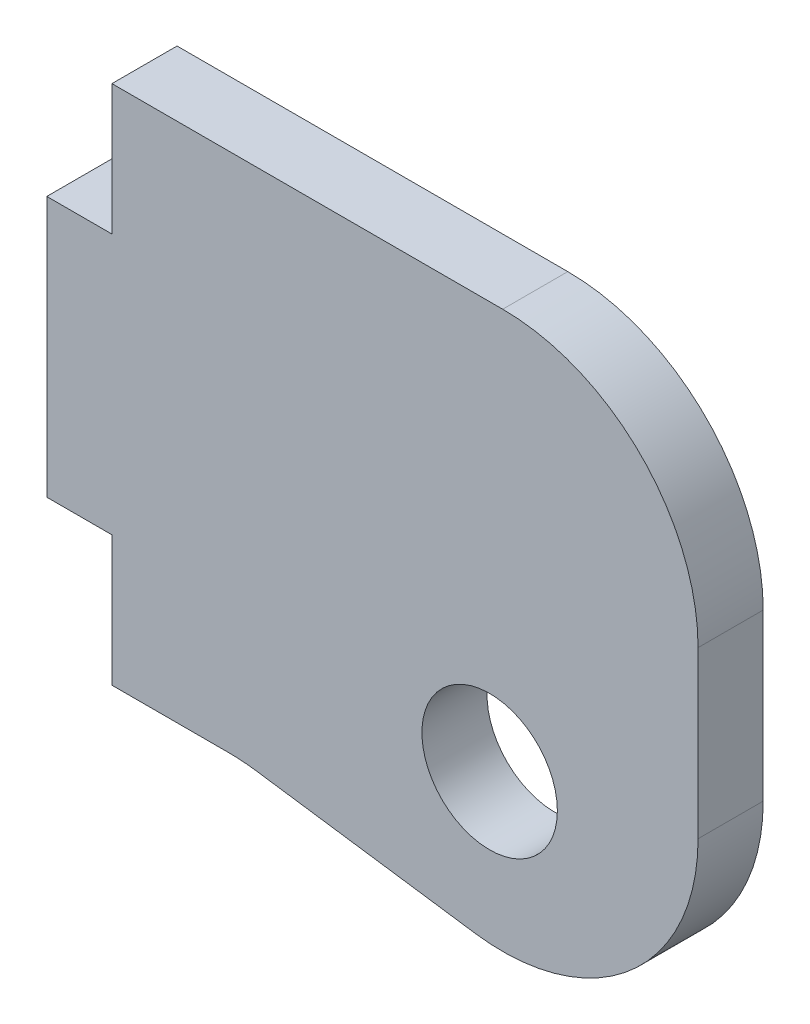
ISO-10303-21;
HEADER;
FILE_DESCRIPTION(('STEP AP214'),'2;1');
FILE_NAME('part.step','',(''),(''),'','','');
FILE_SCHEMA(('AUTOMOTIVE_DESIGN { 1 0 10303 214 1 1 1 1 }'));
ENDSEC;
DATA;
#1=APPLICATION_CONTEXT('core data for automotive mechanical design processes');
#2=APPLICATION_PROTOCOL_DEFINITION('international standard','automotive_design',2000,#1);
#3=PRODUCT_CONTEXT('',#1,'mechanical');
#4=PRODUCT('Part','Part','',(#3));
#5=PRODUCT_RELATED_PRODUCT_CATEGORY('part','',(#4));
#6=PRODUCT_DEFINITION_FORMATION('','',#4);
#7=PRODUCT_DEFINITION_CONTEXT('part definition',#1,'design');
#8=PRODUCT_DEFINITION('design','',#6,#7);
#9=PRODUCT_DEFINITION_SHAPE('','',#8);
#10=(LENGTH_UNIT() NAMED_UNIT(*) SI_UNIT(.MILLI.,.METRE.));
#11=(NAMED_UNIT(*) PLANE_ANGLE_UNIT() SI_UNIT($,.RADIAN.));
#12=(NAMED_UNIT(*) SI_UNIT($,.STERADIAN.) SOLID_ANGLE_UNIT());
#13=UNCERTAINTY_MEASURE_WITH_UNIT(LENGTH_MEASURE(1.E-05),#10,'distance_accuracy_value','');
#14=(GEOMETRIC_REPRESENTATION_CONTEXT(3) GLOBAL_UNCERTAINTY_ASSIGNED_CONTEXT((#13)) GLOBAL_UNIT_ASSIGNED_CONTEXT((#10,
#11,#12)) REPRESENTATION_CONTEXT('',''));
#15=CARTESIAN_POINT('',(0.,0.,0.));
#16=DIRECTION('',(0.,0.,1.));
#17=DIRECTION('',(1.,0.,0.));
#18=AXIS2_PLACEMENT_3D('',#15,#16,#17);
#19=CARTESIAN_POINT('',(31.75,12.7,3.175));
#20=DIRECTION('',(0.,-1.,0.));
#21=DIRECTION('',(1.,0.,0.));
#22=AXIS2_PLACEMENT_3D('',#19,#20,#21);
#23=PLANE('',#22);
#24=DIRECTION('',(-1.,0.,0.));
#25=VECTOR('',#24,1.);
#26=CARTESIAN_POINT('',(31.75,12.7,0.));
#27=LINE('',#26,#25);
#28=CARTESIAN_POINT('',(22.225,12.7,0.));
#29=VERTEX_POINT('',#28);
#30=CARTESIAN_POINT('',(3.175,12.7,0.));
#31=VERTEX_POINT('',#30);
#32=EDGE_CURVE('E150',#29,#31,#27,.T.);
#33=ORIENTED_EDGE('',*,*,#32,.T.);
#34=DIRECTION('',(0.,0.,1.));
#35=VECTOR('',#34,1.);
#36=CARTESIAN_POINT('',(3.175,12.7,0.));
#37=LINE('',#36,#35);
#38=CARTESIAN_POINT('',(3.175,12.7,3.175));
#39=VERTEX_POINT('',#38);
#40=EDGE_CURVE('E197',#31,#39,#37,.T.);
#41=ORIENTED_EDGE('',*,*,#40,.T.);
#42=DIRECTION('',(-1.,0.,0.));
#43=VECTOR('',#42,1.);
#44=CARTESIAN_POINT('',(31.75,12.7,3.175));
#45=LINE('',#44,#43);
#46=CARTESIAN_POINT('',(22.225,12.7,3.175));
#47=VERTEX_POINT('',#46);
#48=EDGE_CURVE('E156',#47,#39,#45,.T.);
#49=ORIENTED_EDGE('',*,*,#48,.F.);
#50=DIRECTION('',(0.,0.,-1.));
#51=VECTOR('',#50,1.);
#52=CARTESIAN_POINT('',(22.225,12.7,3.175));
#53=LINE('',#52,#51);
#54=EDGE_CURVE('E165',#47,#29,#53,.T.);
#55=ORIENTED_EDGE('',*,*,#54,.T.);
#56=EDGE_LOOP('',(#33,#41,#49,#55));
#57=FACE_BOUND('',#56,.T.);
#58=ADVANCED_FACE('F34',(#57),#23,.F.);
#59=CARTESIAN_POINT('',(0.,12.7,3.175));
#60=DIRECTION('',(1.,0.,0.));
#61=DIRECTION('',(0.,1.,0.));
#62=AXIS2_PLACEMENT_3D('',#59,#60,#61);
#63=PLANE('',#62);
#64=DIRECTION('',(0.,-1.,0.));
#65=VECTOR('',#64,1.);
#66=CARTESIAN_POINT('',(0.,12.7,0.));
#67=LINE('',#66,#65);
#68=CARTESIAN_POINT('',(0.,6.35000000000001,0.));
#69=VERTEX_POINT('',#68);
#70=CARTESIAN_POINT('',(0.,-6.34999999999999,0.));
#71=VERTEX_POINT('',#70);
#72=EDGE_CURVE('E144',#69,#71,#67,.T.);
#73=ORIENTED_EDGE('',*,*,#72,.T.);
#74=DIRECTION('',(0.,0.,1.));
#75=VECTOR('',#74,1.);
#76=CARTESIAN_POINT('',(0.,-6.34999999999999,0.));
#77=LINE('',#76,#75);
#78=CARTESIAN_POINT('',(0.,-6.34999999999999,3.175));
#79=VERTEX_POINT('',#78);
#80=EDGE_CURVE('E230',#71,#79,#77,.T.);
#81=ORIENTED_EDGE('',*,*,#80,.T.);
#82=DIRECTION('',(0.,-1.,0.));
#83=VECTOR('',#82,1.);
#84=CARTESIAN_POINT('',(0.,12.7,3.175));
#85=LINE('',#84,#83);
#86=CARTESIAN_POINT('',(0.,6.35000000000001,3.175));
#87=VERTEX_POINT('',#86);
#88=EDGE_CURVE('E198',#87,#79,#85,.T.);
#89=ORIENTED_EDGE('',*,*,#88,.F.);
#90=DIRECTION('',(0.,0.,1.));
#91=VECTOR('',#90,1.);
#92=CARTESIAN_POINT('',(0.,6.35000000000001,0.));
#93=LINE('',#92,#91);
#94=EDGE_CURVE('E233',#69,#87,#93,.T.);
#95=ORIENTED_EDGE('',*,*,#94,.F.);
#96=EDGE_LOOP('',(#73,#81,#89,#95));
#97=FACE_BOUND('',#96,.T.);
#98=ADVANCED_FACE('F255',(#97),#63,.F.);
#99=CARTESIAN_POINT('',(0.,-12.7,3.175));
#100=DIRECTION('',(0.,1.,0.));
#101=DIRECTION('',(-1.,0.,0.));
#102=AXIS2_PLACEMENT_3D('',#99,#100,#101);
#103=PLANE('',#102);
#104=DIRECTION('',(1.,0.,0.));
#105=VECTOR('',#104,1.);
#106=CARTESIAN_POINT('',(0.,-12.7,3.175));
#107=LINE('',#106,#105);
#108=CARTESIAN_POINT('',(3.175,-12.7,3.175));
#109=VERTEX_POINT('',#108);
#110=CARTESIAN_POINT('',(8.84807909198137,-12.7,3.175));
#111=VERTEX_POINT('',#110);
#112=EDGE_CURVE('E138',#109,#111,#107,.T.);
#113=ORIENTED_EDGE('',*,*,#112,.F.);
#114=DIRECTION('',(0.,0.,1.));
#115=VECTOR('',#114,1.);
#116=CARTESIAN_POINT('',(3.175,-12.7,0.));
#117=LINE('',#116,#115);
#118=CARTESIAN_POINT('',(3.175,-12.7,0.));
#119=VERTEX_POINT('',#118);
#120=EDGE_CURVE('E125',#119,#109,#117,.T.);
#121=ORIENTED_EDGE('',*,*,#120,.F.);
#122=DIRECTION('',(1.,0.,0.));
#123=VECTOR('',#122,1.);
#124=CARTESIAN_POINT('',(0.,-12.7,0.));
#125=LINE('',#124,#123);
#126=CARTESIAN_POINT('',(8.84807909198137,-12.7,0.));
#127=VERTEX_POINT('',#126);
#128=EDGE_CURVE('E136',#119,#127,#125,.T.);
#129=ORIENTED_EDGE('',*,*,#128,.T.);
#130=DIRECTION('',(0.,0.,-1.));
#131=VECTOR('',#130,1.);
#132=CARTESIAN_POINT('',(8.84807909198137,-12.7,3.175));
#133=LINE('',#132,#131);
#134=EDGE_CURVE('E163',#127,#111,#133,.F.);
#135=ORIENTED_EDGE('',*,*,#134,.T.);
#136=EDGE_LOOP('',(#113,#121,#129,#135));
#137=FACE_BOUND('',#136,.T.);
#138=ADVANCED_FACE('F134',(#137),#103,.F.);
#139=CARTESIAN_POINT('',(9.525,-12.7,3.175));
#140=DIRECTION('',(0.141421356237309,0.989949493661167,0.));
#141=DIRECTION('',(-0.989949493661167,0.141421356237309,0.));
#142=AXIS2_PLACEMENT_3D('',#139,#140,#141);
#143=PLANE('',#142);
#144=DIRECTION('',(0.989949493661167,-0.141421356237309,0.));
#145=VECTOR('',#144,1.);
#146=CARTESIAN_POINT('',(9.525,-12.7,3.175));
#147=LINE('',#146,#145);
#148=CARTESIAN_POINT('',(10.1951175101417,-12.7957310728774,3.175));
#149=VERTEX_POINT('',#148);
#150=CARTESIAN_POINT('',(20.8779615818396,-14.3218516545485,3.175));
#151=VERTEX_POINT('',#150);
#152=EDGE_CURVE('E213',#149,#151,#147,.T.);
#153=ORIENTED_EDGE('',*,*,#152,.F.);
#154=DIRECTION('',(0.,0.,-1.));
#155=VECTOR('',#154,1.);
#156=CARTESIAN_POINT('',(10.1951175101417,-12.7957310728774,0.));
#157=LINE('',#156,#155);
#158=CARTESIAN_POINT('',(10.1951175101417,-12.7957310728774,0.));
#159=VERTEX_POINT('',#158);
#160=EDGE_CURVE('E159',#149,#159,#157,.T.);
#161=ORIENTED_EDGE('',*,*,#160,.T.);
#162=DIRECTION('',(0.989949493661167,-0.141421356237309,0.));
#163=VECTOR('',#162,1.);
#164=CARTESIAN_POINT('',(9.525,-12.7,0.));
#165=LINE('',#164,#163);
#166=CARTESIAN_POINT('',(20.8779615818396,-14.3218516545485,0.));
#167=VERTEX_POINT('',#166);
#168=EDGE_CURVE('E143',#159,#167,#165,.T.);
#169=ORIENTED_EDGE('',*,*,#168,.T.);
#170=DIRECTION('',(0.,0.,-1.));
#171=VECTOR('',#170,1.);
#172=CARTESIAN_POINT('',(20.8779615818396,-14.3218516545485,3.175));
#173=LINE('',#172,#171);
#174=EDGE_CURVE('E157',#167,#151,#173,.F.);
#175=ORIENTED_EDGE('',*,*,#174,.T.);
#176=EDGE_LOOP('',(#153,#161,#169,#175));
#177=FACE_BOUND('',#176,.T.);
#178=ADVANCED_FACE('F210',(#177),#143,.F.);
#179=CARTESIAN_POINT('',(31.75,-15.875,3.175));
#180=DIRECTION('',(-1.,0.,0.));
#181=DIRECTION('',(0.,-1.,0.));
#182=AXIS2_PLACEMENT_3D('',#179,#180,#181);
#183=PLANE('',#182);
#184=DIRECTION('',(0.,1.,0.));
#185=VECTOR('',#184,1.);
#186=CARTESIAN_POINT('',(31.75,-15.875,0.));
#187=LINE('',#186,#185);
#188=CARTESIAN_POINT('',(31.75,-4.8925827274259,0.));
#189=VERTEX_POINT('',#188);
#190=CARTESIAN_POINT('',(31.75,3.17500000000001,0.));
#191=VERTEX_POINT('',#190);
#192=EDGE_CURVE('E147',#189,#191,#187,.T.);
#193=ORIENTED_EDGE('',*,*,#192,.T.);
#194=DIRECTION('',(0.,0.,-1.));
#195=VECTOR('',#194,1.);
#196=CARTESIAN_POINT('',(31.75,3.17500000000001,3.175));
#197=LINE('',#196,#195);
#198=CARTESIAN_POINT('',(31.75,3.17500000000001,3.175));
#199=VERTEX_POINT('',#198);
#200=EDGE_CURVE('E175',#191,#199,#197,.F.);
#201=ORIENTED_EDGE('',*,*,#200,.T.);
#202=DIRECTION('',(0.,1.,0.));
#203=VECTOR('',#202,1.);
#204=CARTESIAN_POINT('',(31.75,-15.875,3.175));
#205=LINE('',#204,#203);
#206=CARTESIAN_POINT('',(31.75,-4.8925827274259,3.175));
#207=VERTEX_POINT('',#206);
#208=EDGE_CURVE('E160',#207,#199,#205,.T.);
#209=ORIENTED_EDGE('',*,*,#208,.F.);
#210=DIRECTION('',(0.,0.,-1.));
#211=VECTOR('',#210,1.);
#212=CARTESIAN_POINT('',(31.75,-4.8925827274259,3.175));
#213=LINE('',#212,#211);
#214=EDGE_CURVE('E172',#207,#189,#213,.T.);
#215=ORIENTED_EDGE('',*,*,#214,.T.);
#216=EDGE_LOOP('',(#193,#201,#209,#215));
#217=FACE_BOUND('',#216,.T.);
#218=ADVANCED_FACE('F203',(#217),#183,.F.);
#219=CARTESIAN_POINT('',(0.,0.,3.175));
#220=DIRECTION('',(0.,0.,1.));
#221=DIRECTION('',(1.,0.,0.));
#222=AXIS2_PLACEMENT_3D('',#219,#220,#221);
#223=PLANE('',#222);
#224=DIRECTION('',(-1.,0.,0.));
#225=VECTOR('',#224,1.);
#226=CARTESIAN_POINT('',(0.,-6.34999999999999,3.175));
#227=LINE('',#226,#225);
#228=CARTESIAN_POINT('',(3.175,-6.34999999999999,3.175));
#229=VERTEX_POINT('',#228);
#230=EDGE_CURVE('E130',#229,#79,#227,.T.);
#231=ORIENTED_EDGE('',*,*,#230,.F.);
#232=DIRECTION('',(0.,1.,0.));
#233=VECTOR('',#232,1.);
#234=CARTESIAN_POINT('',(3.175,-12.7,3.175));
#235=LINE('',#234,#233);
#236=EDGE_CURVE('E217',#109,#229,#235,.T.);
#237=ORIENTED_EDGE('',*,*,#236,.F.);
#238=ORIENTED_EDGE('',*,*,#112,.T.);
#239=CARTESIAN_POINT('',(8.84807909198136,-22.225,3.175));
#240=DIRECTION('',(0.,0.,1.));
#241=DIRECTION('',(1.,0.,0.));
#242=AXIS2_PLACEMENT_3D('',#239,#240,#241);
#243=CIRCLE('',#242,9.525);
#244=EDGE_CURVE('E11',#111,#149,#243,.F.);
#245=ORIENTED_EDGE('',*,*,#244,.T.);
#246=ORIENTED_EDGE('',*,*,#152,.T.);
#247=CARTESIAN_POINT('',(22.225,-4.8925827274259,3.175));
#248=DIRECTION('',(0.,0.,1.));
#249=DIRECTION('',(1.,0.,0.));
#250=AXIS2_PLACEMENT_3D('',#247,#248,#249);
#251=CIRCLE('',#250,9.525);
#252=EDGE_CURVE('E177',#151,#207,#251,.T.);
#253=ORIENTED_EDGE('',*,*,#252,.T.);
#254=ORIENTED_EDGE('',*,*,#208,.T.);
#255=CARTESIAN_POINT('',(22.225,3.17500000000001,3.175));
#256=DIRECTION('',(0.,0.,1.));
#257=DIRECTION('',(1.,0.,0.));
#258=AXIS2_PLACEMENT_3D('',#255,#256,#257);
#259=CIRCLE('',#258,9.525);
#260=EDGE_CURVE('E179',#199,#47,#259,.T.);
#261=ORIENTED_EDGE('',*,*,#260,.T.);
#262=ORIENTED_EDGE('',*,*,#48,.T.);
#263=DIRECTION('',(0.,1.,0.));
#264=VECTOR('',#263,1.);
#265=CARTESIAN_POINT('',(3.175,12.7,3.175));
#266=LINE('',#265,#264);
#267=CARTESIAN_POINT('',(3.175,6.35000000000001,3.175));
#268=VERTEX_POINT('',#267);
#269=EDGE_CURVE('E238',#268,#39,#266,.T.);
#270=ORIENTED_EDGE('',*,*,#269,.F.);
#271=DIRECTION('',(1.,0.,0.));
#272=VECTOR('',#271,1.);
#273=CARTESIAN_POINT('',(0.,6.35000000000001,3.175));
#274=LINE('',#273,#272);
#275=EDGE_CURVE('E241',#87,#268,#274,.T.);
#276=ORIENTED_EDGE('',*,*,#275,.F.);
#277=ORIENTED_EDGE('',*,*,#88,.T.);
#278=EDGE_LOOP('',(#231,#237,#238,#245,#246,#253,#254,#261,#262,#270,#276,#277));
#279=FACE_BOUND('',#278,.T.);
#280=CARTESIAN_POINT('',(21.5882999780113,-7.14087159890308,3.175));
#281=DIRECTION('',(0.,0.,1.));
#282=DIRECTION('',(1.,0.,0.));
#283=AXIS2_PLACEMENT_3D('',#280,#281,#282);
#284=CIRCLE('',#283,3.302);
#285=CARTESIAN_POINT('',(24.8902999780113,-7.14087159890308,3.175));
#286=VERTEX_POINT('',#285);
#287=EDGE_CURVE('E225',#286,#286,#284,.T.);
#288=ORIENTED_EDGE('',*,*,#287,.F.);
#289=EDGE_LOOP('',(#288));
#290=FACE_BOUND('',#289,.T.);
#291=ADVANCED_FACE('F186',(#279,#290),#223,.T.);
#292=CARTESIAN_POINT('',(0.,0.,0.));
#293=DIRECTION('',(0.,0.,1.));
#294=DIRECTION('',(1.,0.,0.));
#295=AXIS2_PLACEMENT_3D('',#292,#293,#294);
#296=PLANE('',#295);
#297=CARTESIAN_POINT('',(21.5882999780113,-7.14087159890308,0.));
#298=DIRECTION('',(0.,0.,1.));
#299=DIRECTION('',(1.,0.,0.));
#300=AXIS2_PLACEMENT_3D('',#297,#298,#299);
#301=CIRCLE('',#300,3.302);
#302=CARTESIAN_POINT('',(24.8902999780113,-7.14087159890308,0.));
#303=VERTEX_POINT('',#302);
#304=EDGE_CURVE('E223',#303,#303,#301,.T.);
#305=ORIENTED_EDGE('',*,*,#304,.T.);
#306=EDGE_LOOP('',(#305));
#307=FACE_BOUND('',#306,.T.);
#308=DIRECTION('',(0.,1.,0.));
#309=VECTOR('',#308,1.);
#310=CARTESIAN_POINT('',(3.175,-12.7,0.));
#311=LINE('',#310,#309);
#312=CARTESIAN_POINT('',(3.175,-6.34999999999999,0.));
#313=VERTEX_POINT('',#312);
#314=EDGE_CURVE('E121',#119,#313,#311,.T.);
#315=ORIENTED_EDGE('',*,*,#314,.T.);
#316=DIRECTION('',(-1.,0.,0.));
#317=VECTOR('',#316,1.);
#318=CARTESIAN_POINT('',(0.,-6.34999999999999,0.));
#319=LINE('',#318,#317);
#320=EDGE_CURVE('E49',#313,#71,#319,.T.);
#321=ORIENTED_EDGE('',*,*,#320,.T.);
#322=ORIENTED_EDGE('',*,*,#72,.F.);
#323=DIRECTION('',(1.,0.,0.));
#324=VECTOR('',#323,1.);
#325=CARTESIAN_POINT('',(0.,6.35000000000001,0.));
#326=LINE('',#325,#324);
#327=CARTESIAN_POINT('',(3.175,6.35000000000001,0.));
#328=VERTEX_POINT('',#327);
#329=EDGE_CURVE('E240',#69,#328,#326,.T.);
#330=ORIENTED_EDGE('',*,*,#329,.T.);
#331=DIRECTION('',(0.,1.,0.));
#332=VECTOR('',#331,1.);
#333=CARTESIAN_POINT('',(3.175,12.7,0.));
#334=LINE('',#333,#332);
#335=EDGE_CURVE('E57',#328,#31,#334,.T.);
#336=ORIENTED_EDGE('',*,*,#335,.T.);
#337=ORIENTED_EDGE('',*,*,#32,.F.);
#338=CARTESIAN_POINT('',(22.225,3.17500000000001,0.));
#339=DIRECTION('',(0.,0.,1.));
#340=DIRECTION('',(1.,0.,0.));
#341=AXIS2_PLACEMENT_3D('',#338,#339,#340);
#342=CIRCLE('',#341,9.525);
#343=EDGE_CURVE('E170',#29,#191,#342,.F.);
#344=ORIENTED_EDGE('',*,*,#343,.T.);
#345=ORIENTED_EDGE('',*,*,#192,.F.);
#346=CARTESIAN_POINT('',(22.225,-4.8925827274259,0.));
#347=DIRECTION('',(0.,0.,1.));
#348=DIRECTION('',(1.,0.,0.));
#349=AXIS2_PLACEMENT_3D('',#346,#347,#348);
#350=CIRCLE('',#349,9.525);
#351=EDGE_CURVE('E168',#189,#167,#350,.F.);
#352=ORIENTED_EDGE('',*,*,#351,.T.);
#353=ORIENTED_EDGE('',*,*,#168,.F.);
#354=CARTESIAN_POINT('',(8.84807909198136,-22.225,0.));
#355=DIRECTION('',(0.,0.,1.));
#356=DIRECTION('',(1.,0.,0.));
#357=AXIS2_PLACEMENT_3D('',#354,#355,#356);
#358=CIRCLE('',#357,9.525);
#359=EDGE_CURVE('E42',#159,#127,#358,.T.);
#360=ORIENTED_EDGE('',*,*,#359,.T.);
#361=ORIENTED_EDGE('',*,*,#128,.F.);
#362=EDGE_LOOP('',(#315,#321,#322,#330,#336,#337,#344,#345,#352,#353,#360,#361));
#363=FACE_BOUND('',#362,.T.);
#364=ADVANCED_FACE('F140',(#307,#363),#296,.F.);
#365=CARTESIAN_POINT('',(21.5882999780113,-7.14087159890308,0.));
#366=DIRECTION('',(0.,0.,1.));
#367=DIRECTION('',(1.,0.,0.));
#368=AXIS2_PLACEMENT_3D('',#365,#366,#367);
#369=CYLINDRICAL_SURFACE('',#368,3.302);
#370=ORIENTED_EDGE('',*,*,#304,.F.);
#371=EDGE_LOOP('',(#370));
#372=FACE_BOUND('',#371,.T.);
#373=ORIENTED_EDGE('',*,*,#287,.T.);
#374=EDGE_LOOP('',(#373));
#375=FACE_BOUND('',#374,.T.);
#376=ADVANCED_FACE('F279',(#372,#375),#369,.F.);
#377=CARTESIAN_POINT('',(8.84807909198136,-22.225,3.175));
#378=DIRECTION('',(0.,0.,1.));
#379=DIRECTION('',(1.,0.,0.));
#380=AXIS2_PLACEMENT_3D('',#377,#378,#379);
#381=CYLINDRICAL_SURFACE('',#380,9.525);
#382=ORIENTED_EDGE('',*,*,#244,.F.);
#383=ORIENTED_EDGE('',*,*,#134,.F.);
#384=ORIENTED_EDGE('',*,*,#359,.F.);
#385=ORIENTED_EDGE('',*,*,#160,.F.);
#386=EDGE_LOOP('',(#382,#383,#384,#385));
#387=FACE_BOUND('',#386,.T.);
#388=ADVANCED_FACE('F216',(#387),#381,.F.);
#389=CARTESIAN_POINT('',(22.225,3.17500000000001,3.175));
#390=DIRECTION('',(0.,0.,-1.));
#391=DIRECTION('',(-1.,0.,0.));
#392=AXIS2_PLACEMENT_3D('',#389,#390,#391);
#393=CYLINDRICAL_SURFACE('',#392,9.525);
#394=ORIENTED_EDGE('',*,*,#260,.F.);
#395=ORIENTED_EDGE('',*,*,#200,.F.);
#396=ORIENTED_EDGE('',*,*,#343,.F.);
#397=ORIENTED_EDGE('',*,*,#54,.F.);
#398=EDGE_LOOP('',(#394,#395,#396,#397));
#399=FACE_BOUND('',#398,.T.);
#400=ADVANCED_FACE('F200',(#399),#393,.T.);
#401=CARTESIAN_POINT('',(22.225,-4.8925827274259,3.175));
#402=DIRECTION('',(0.,0.,-1.));
#403=DIRECTION('',(-1.,0.,0.));
#404=AXIS2_PLACEMENT_3D('',#401,#402,#403);
#405=CYLINDRICAL_SURFACE('',#404,9.525);
#406=ORIENTED_EDGE('',*,*,#252,.F.);
#407=ORIENTED_EDGE('',*,*,#174,.F.);
#408=ORIENTED_EDGE('',*,*,#351,.F.);
#409=ORIENTED_EDGE('',*,*,#214,.F.);
#410=EDGE_LOOP('',(#406,#407,#408,#409));
#411=FACE_BOUND('',#410,.T.);
#412=ADVANCED_FACE('F36',(#411),#405,.T.);
#413=CARTESIAN_POINT('',(3.175,12.7,0.));
#414=DIRECTION('',(1.,0.,0.));
#415=DIRECTION('',(0.,1.,0.));
#416=AXIS2_PLACEMENT_3D('',#413,#414,#415);
#417=PLANE('',#416);
#418=ORIENTED_EDGE('',*,*,#269,.T.);
#419=ORIENTED_EDGE('',*,*,#40,.F.);
#420=ORIENTED_EDGE('',*,*,#335,.F.);
#421=DIRECTION('',(0.,0.,1.));
#422=VECTOR('',#421,1.);
#423=CARTESIAN_POINT('',(3.175,6.35000000000001,0.));
#424=LINE('',#423,#422);
#425=EDGE_CURVE('E235',#328,#268,#424,.T.);
#426=ORIENTED_EDGE('',*,*,#425,.T.);
#427=EDGE_LOOP('',(#418,#419,#420,#426));
#428=FACE_BOUND('',#427,.T.);
#429=ADVANCED_FACE('F260',(#428),#417,.F.);
#430=CARTESIAN_POINT('',(0.,6.35000000000001,0.));
#431=DIRECTION('',(0.,-1.,0.));
#432=DIRECTION('',(0.,0.,-1.));
#433=AXIS2_PLACEMENT_3D('',#430,#431,#432);
#434=PLANE('',#433);
#435=ORIENTED_EDGE('',*,*,#275,.T.);
#436=ORIENTED_EDGE('',*,*,#425,.F.);
#437=ORIENTED_EDGE('',*,*,#329,.F.);
#438=ORIENTED_EDGE('',*,*,#94,.T.);
#439=EDGE_LOOP('',(#435,#436,#437,#438));
#440=FACE_BOUND('',#439,.T.);
#441=ADVANCED_FACE('F259',(#440),#434,.F.);
#442=CARTESIAN_POINT('',(0.,-6.34999999999999,0.));
#443=DIRECTION('',(0.,1.,0.));
#444=DIRECTION('',(0.,0.,1.));
#445=AXIS2_PLACEMENT_3D('',#442,#443,#444);
#446=PLANE('',#445);
#447=ORIENTED_EDGE('',*,*,#230,.T.);
#448=ORIENTED_EDGE('',*,*,#80,.F.);
#449=ORIENTED_EDGE('',*,*,#320,.F.);
#450=DIRECTION('',(0.,0.,1.));
#451=VECTOR('',#450,1.);
#452=CARTESIAN_POINT('',(3.175,-6.34999999999999,0.));
#453=LINE('',#452,#451);
#454=EDGE_CURVE('E127',#313,#229,#453,.T.);
#455=ORIENTED_EDGE('',*,*,#454,.T.);
#456=EDGE_LOOP('',(#447,#448,#449,#455));
#457=FACE_BOUND('',#456,.T.);
#458=ADVANCED_FACE('F267',(#457),#446,.F.);
#459=CARTESIAN_POINT('',(3.175,-12.7,0.));
#460=DIRECTION('',(1.,0.,0.));
#461=DIRECTION('',(0.,0.,-1.));
#462=AXIS2_PLACEMENT_3D('',#459,#460,#461);
#463=PLANE('',#462);
#464=ORIENTED_EDGE('',*,*,#236,.T.);
#465=ORIENTED_EDGE('',*,*,#454,.F.);
#466=ORIENTED_EDGE('',*,*,#314,.F.);
#467=ORIENTED_EDGE('',*,*,#120,.T.);
#468=EDGE_LOOP('',(#464,#465,#466,#467));
#469=FACE_BOUND('',#468,.T.);
#470=ADVANCED_FACE('F124',(#469),#463,.F.);
#471=CLOSED_SHELL('',(#58,#98,#138,#178,#218,#291,#364,#376,#388,#400,#412,#429,#441,#458,#470));
#472=MANIFOLD_SOLID_BREP('B2',#471);
#473=ADVANCED_BREP_SHAPE_REPRESENTATION('',(#18,#472),#14);
#474=SHAPE_DEFINITION_REPRESENTATION(#9,#473);
ENDSEC;
END-ISO-10303-21;
